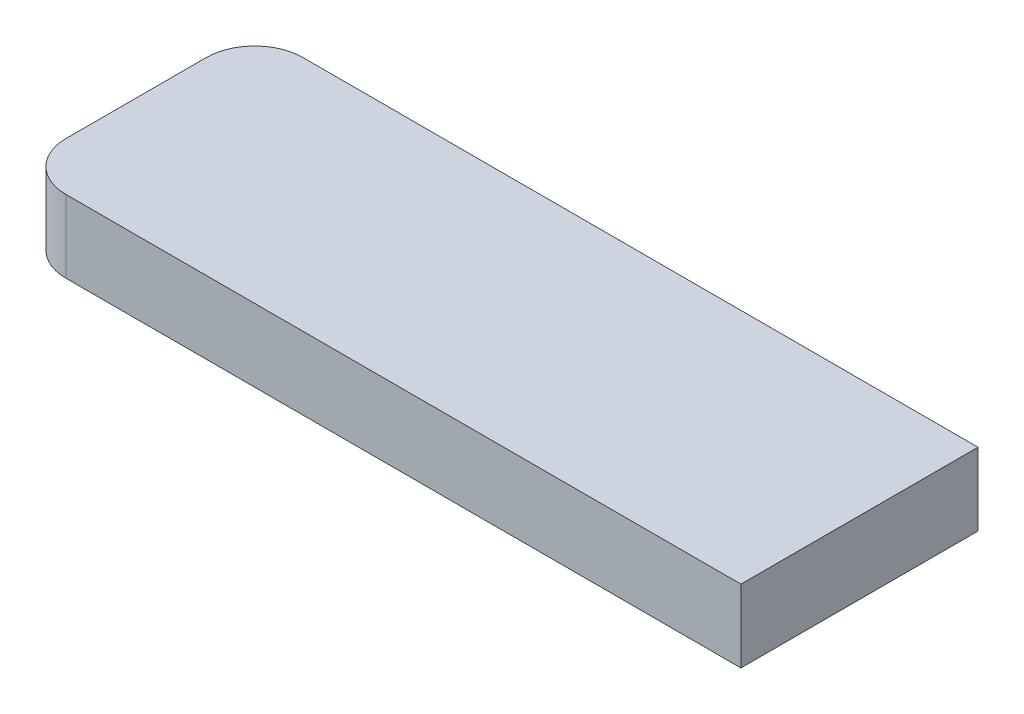
ISO-10303-21;
HEADER;
FILE_DESCRIPTION(('STEP AP214'),'2;1');
FILE_NAME('part.step','',(''),(''),'','','');
FILE_SCHEMA(('AUTOMOTIVE_DESIGN { 1 0 10303 214 1 1 1 1 }'));
ENDSEC;
DATA;
#1=APPLICATION_CONTEXT('core data for automotive mechanical design processes');
#2=APPLICATION_PROTOCOL_DEFINITION('international standard','automotive_design',2000,#1);
#3=PRODUCT_CONTEXT('',#1,'mechanical');
#4=PRODUCT('Part','Part','',(#3));
#5=PRODUCT_RELATED_PRODUCT_CATEGORY('part','',(#4));
#6=PRODUCT_DEFINITION_FORMATION('','',#4);
#7=PRODUCT_DEFINITION_CONTEXT('part definition',#1,'design');
#8=PRODUCT_DEFINITION('design','',#6,#7);
#9=PRODUCT_DEFINITION_SHAPE('','',#8);
#10=(LENGTH_UNIT() NAMED_UNIT(*) SI_UNIT(.MILLI.,.METRE.));
#11=(NAMED_UNIT(*) PLANE_ANGLE_UNIT() SI_UNIT($,.RADIAN.));
#12=(NAMED_UNIT(*) SI_UNIT($,.STERADIAN.) SOLID_ANGLE_UNIT());
#13=UNCERTAINTY_MEASURE_WITH_UNIT(LENGTH_MEASURE(1.E-05),#10,'distance_accuracy_value','');
#14=(GEOMETRIC_REPRESENTATION_CONTEXT(3) GLOBAL_UNCERTAINTY_ASSIGNED_CONTEXT((#13)) GLOBAL_UNIT_ASSIGNED_CONTEXT((#10,
#11,#12)) REPRESENTATION_CONTEXT('',''));
#15=CARTESIAN_POINT('',(0.,0.,0.));
#16=DIRECTION('',(0.,0.,1.));
#17=DIRECTION('',(1.,0.,0.));
#18=AXIS2_PLACEMENT_3D('',#15,#16,#17);
#19=CARTESIAN_POINT('',(300.,1.71683972880179E-13,0.));
#20=DIRECTION('',(-1.,0.,0.));
#21=DIRECTION('',(0.,-1.,0.));
#22=AXIS2_PLACEMENT_3D('',#19,#20,#21);
#23=PLANE('',#22);
#24=DIRECTION('',(0.,1.,0.));
#25=VECTOR('',#24,1.);
#26=CARTESIAN_POINT('',(300.,-120.,13.1));
#27=LINE('',#26,#25);
#28=CARTESIAN_POINT('',(300.,-50.,13.1));
#29=VERTEX_POINT('',#28);
#30=CARTESIAN_POINT('',(300.,-47.,13.1));
#31=VERTEX_POINT('',#30);
#32=EDGE_CURVE('E35',#29,#31,#27,.T.);
#33=ORIENTED_EDGE('',*,*,#32,.T.);
#34=DIRECTION('',(0.,0.,1.));
#35=VECTOR('',#34,1.);
#36=CARTESIAN_POINT('',(300.,-47.,3.));
#37=LINE('',#36,#35);
#38=CARTESIAN_POINT('',(300.,-47.,22.9));
#39=VERTEX_POINT('',#38);
#40=EDGE_CURVE('E90',#31,#39,#37,.T.);
#41=ORIENTED_EDGE('',*,*,#40,.T.);
#42=DIRECTION('',(0.,1.,0.));
#43=VECTOR('',#42,1.);
#44=CARTESIAN_POINT('',(300.,-120.,22.9));
#45=LINE('',#44,#43);
#46=CARTESIAN_POINT('',(300.,-50.,22.9));
#47=VERTEX_POINT('',#46);
#48=EDGE_CURVE('E55',#47,#39,#45,.T.);
#49=ORIENTED_EDGE('',*,*,#48,.F.);
#50=DIRECTION('',(0.,0.,-1.));
#51=VECTOR('',#50,1.);
#52=CARTESIAN_POINT('',(300.,-50.,60.));
#53=LINE('',#52,#51);
#54=EDGE_CURVE('E48',#47,#29,#53,.T.);
#55=ORIENTED_EDGE('',*,*,#54,.T.);
#56=EDGE_LOOP('',(#33,#41,#49,#55));
#57=FACE_BOUND('',#56,.T.);
#58=ADVANCED_FACE('F32',(#57),#23,.F.);
#59=CARTESIAN_POINT('',(270.1,-120.,13.1));
#60=DIRECTION('',(1.,0.,0.));
#61=DIRECTION('',(0.,0.,-1.));
#62=AXIS2_PLACEMENT_3D('',#59,#60,#61);
#63=PLANE('',#62);
#64=DIRECTION('',(0.,0.,-1.));
#65=VECTOR('',#64,1.);
#66=CARTESIAN_POINT('',(270.1,-50.,60.));
#67=LINE('',#66,#65);
#68=CARTESIAN_POINT('',(270.1,-50.,20.9));
#69=VERTEX_POINT('',#68);
#70=CARTESIAN_POINT('',(270.1,-50.,15.1));
#71=VERTEX_POINT('',#70);
#72=EDGE_CURVE('E11',#69,#71,#67,.T.);
#73=ORIENTED_EDGE('',*,*,#72,.F.);
#74=DIRECTION('',(0.,-1.,0.));
#75=VECTOR('',#74,1.);
#76=CARTESIAN_POINT('',(270.1,-120.,20.9));
#77=LINE('',#76,#75);
#78=CARTESIAN_POINT('',(270.1,-47.,20.9));
#79=VERTEX_POINT('',#78);
#80=EDGE_CURVE('E127',#69,#79,#77,.F.);
#81=ORIENTED_EDGE('',*,*,#80,.T.);
#82=DIRECTION('',(0.,0.,1.));
#83=VECTOR('',#82,1.);
#84=CARTESIAN_POINT('',(270.1,-47.,3.));
#85=LINE('',#84,#83);
#86=CARTESIAN_POINT('',(270.1,-47.,15.1));
#87=VERTEX_POINT('',#86);
#88=EDGE_CURVE('E40',#87,#79,#85,.T.);
#89=ORIENTED_EDGE('',*,*,#88,.F.);
#90=DIRECTION('',(0.,1.,0.));
#91=VECTOR('',#90,1.);
#92=CARTESIAN_POINT('',(270.1,-120.,15.1));
#93=LINE('',#92,#91);
#94=EDGE_CURVE('E125',#87,#71,#93,.F.);
#95=ORIENTED_EDGE('',*,*,#94,.T.);
#96=EDGE_LOOP('',(#73,#81,#89,#95));
#97=FACE_BOUND('',#96,.T.);
#98=ADVANCED_FACE('F137',(#97),#63,.F.);
#99=CARTESIAN_POINT('',(272.1,-120.,20.9));
#100=DIRECTION('',(0.,-1.,0.));
#101=DIRECTION('',(0.,0.,-1.));
#102=AXIS2_PLACEMENT_3D('',#99,#100,#101);
#103=CYLINDRICAL_SURFACE('',#102,2.);
#104=CARTESIAN_POINT('',(272.1,-47.,20.9));
#105=DIRECTION('',(0.,-1.,0.));
#106=DIRECTION('',(0.,0.,-1.));
#107=AXIS2_PLACEMENT_3D('',#104,#105,#106);
#108=CIRCLE('',#107,2.);
#109=CARTESIAN_POINT('',(272.1,-47.,22.9));
#110=VERTEX_POINT('',#109);
#111=EDGE_CURVE('E115',#79,#110,#108,.F.);
#112=ORIENTED_EDGE('',*,*,#111,.F.);
#113=ORIENTED_EDGE('',*,*,#80,.F.);
#114=CARTESIAN_POINT('',(272.1,-50.,20.9));
#115=DIRECTION('',(0.,1.,0.));
#116=DIRECTION('',(0.,0.,1.));
#117=AXIS2_PLACEMENT_3D('',#114,#115,#116);
#118=CIRCLE('',#117,2.);
#119=CARTESIAN_POINT('',(272.1,-50.,22.9));
#120=VERTEX_POINT('',#119);
#121=EDGE_CURVE('E123',#120,#69,#118,.F.);
#122=ORIENTED_EDGE('',*,*,#121,.F.);
#123=DIRECTION('',(0.,-1.,0.));
#124=VECTOR('',#123,1.);
#125=CARTESIAN_POINT('',(272.1,-120.,22.9));
#126=LINE('',#125,#124);
#127=EDGE_CURVE('E118',#110,#120,#126,.T.);
#128=ORIENTED_EDGE('',*,*,#127,.F.);
#129=EDGE_LOOP('',(#112,#113,#122,#128));
#130=FACE_BOUND('',#129,.T.);
#131=ADVANCED_FACE('F147',(#130),#103,.T.);
#132=CARTESIAN_POINT('',(-300.,-47.,3.));
#133=DIRECTION('',(0.,-1.,0.));
#134=DIRECTION('',(0.,0.,-1.));
#135=AXIS2_PLACEMENT_3D('',#132,#133,#134);
#136=PLANE('',#135);
#137=ORIENTED_EDGE('',*,*,#88,.T.);
#138=ORIENTED_EDGE('',*,*,#111,.T.);
#139=DIRECTION('',(1.,0.,0.));
#140=VECTOR('',#139,1.);
#141=CARTESIAN_POINT('',(-300.,-47.,22.9000000000001));
#142=LINE('',#141,#140);
#143=EDGE_CURVE('E112',#110,#39,#142,.T.);
#144=ORIENTED_EDGE('',*,*,#143,.T.);
#145=ORIENTED_EDGE('',*,*,#40,.F.);
#146=DIRECTION('',(-1.,0.,0.));
#147=VECTOR('',#146,1.);
#148=CARTESIAN_POINT('',(-300.,-47.,13.1000000000001));
#149=LINE('',#148,#147);
#150=CARTESIAN_POINT('',(272.1,-47.,13.1));
#151=VERTEX_POINT('',#150);
#152=EDGE_CURVE('E99',#31,#151,#149,.T.);
#153=ORIENTED_EDGE('',*,*,#152,.T.);
#154=CARTESIAN_POINT('',(272.1,-47.,15.1));
#155=DIRECTION('',(0.,-1.,0.));
#156=DIRECTION('',(0.,0.,-1.));
#157=AXIS2_PLACEMENT_3D('',#154,#155,#156);
#158=CIRCLE('',#157,2.);
#159=EDGE_CURVE('E129',#151,#87,#158,.F.);
#160=ORIENTED_EDGE('',*,*,#159,.T.);
#161=EDGE_LOOP('',(#137,#138,#144,#145,#153,#160));
#162=FACE_BOUND('',#161,.T.);
#163=ADVANCED_FACE('F113',(#162),#136,.F.);
#164=CARTESIAN_POINT('',(272.1,-120.,15.1));
#165=DIRECTION('',(0.,1.,0.));
#166=DIRECTION('',(0.,0.,1.));
#167=AXIS2_PLACEMENT_3D('',#164,#165,#166);
#168=CYLINDRICAL_SURFACE('',#167,2.);
#169=CARTESIAN_POINT('',(272.1,-50.,15.1));
#170=DIRECTION('',(0.,1.,0.));
#171=DIRECTION('',(0.,0.,1.));
#172=AXIS2_PLACEMENT_3D('',#169,#170,#171);
#173=CIRCLE('',#172,2.);
#174=CARTESIAN_POINT('',(272.1,-50.,13.1));
#175=VERTEX_POINT('',#174);
#176=EDGE_CURVE('E102',#71,#175,#173,.F.);
#177=ORIENTED_EDGE('',*,*,#176,.F.);
#178=ORIENTED_EDGE('',*,*,#94,.F.);
#179=ORIENTED_EDGE('',*,*,#159,.F.);
#180=DIRECTION('',(0.,1.,0.));
#181=VECTOR('',#180,1.);
#182=CARTESIAN_POINT('',(272.1,-120.,13.1));
#183=LINE('',#182,#181);
#184=EDGE_CURVE('E89',#175,#151,#183,.T.);
#185=ORIENTED_EDGE('',*,*,#184,.F.);
#186=EDGE_LOOP('',(#177,#178,#179,#185));
#187=FACE_BOUND('',#186,.T.);
#188=ADVANCED_FACE('F139',(#187),#168,.T.);
#189=CARTESIAN_POINT('',(-300.,-50.,60.));
#190=DIRECTION('',(0.,1.,0.));
#191=DIRECTION('',(0.,0.,1.));
#192=AXIS2_PLACEMENT_3D('',#189,#190,#191);
#193=PLANE('',#192);
#194=DIRECTION('',(-1.,0.,0.));
#195=VECTOR('',#194,1.);
#196=CARTESIAN_POINT('',(-300.,-50.,22.9000000000001));
#197=LINE('',#196,#195);
#198=EDGE_CURVE('E109',#47,#120,#197,.T.);
#199=ORIENTED_EDGE('',*,*,#198,.T.);
#200=ORIENTED_EDGE('',*,*,#121,.T.);
#201=ORIENTED_EDGE('',*,*,#72,.T.);
#202=ORIENTED_EDGE('',*,*,#176,.T.);
#203=DIRECTION('',(1.,0.,0.));
#204=VECTOR('',#203,1.);
#205=CARTESIAN_POINT('',(-300.,-50.,13.1000000000001));
#206=LINE('',#205,#204);
#207=EDGE_CURVE('E96',#175,#29,#206,.T.);
#208=ORIENTED_EDGE('',*,*,#207,.T.);
#209=ORIENTED_EDGE('',*,*,#54,.F.);
#210=EDGE_LOOP('',(#199,#200,#201,#202,#208,#209));
#211=FACE_BOUND('',#210,.T.);
#212=ADVANCED_FACE('F100',(#211),#193,.F.);
#213=CARTESIAN_POINT('',(300.,-120.,13.1));
#214=DIRECTION('',(0.,0.,1.));
#215=DIRECTION('',(1.,0.,0.));
#216=AXIS2_PLACEMENT_3D('',#213,#214,#215);
#217=PLANE('',#216);
#218=ORIENTED_EDGE('',*,*,#207,.F.);
#219=ORIENTED_EDGE('',*,*,#184,.T.);
#220=ORIENTED_EDGE('',*,*,#152,.F.);
#221=ORIENTED_EDGE('',*,*,#32,.F.);
#222=EDGE_LOOP('',(#218,#219,#220,#221));
#223=FACE_BOUND('',#222,.T.);
#224=ADVANCED_FACE('F94',(#223),#217,.F.);
#225=CARTESIAN_POINT('',(300.,-120.,22.9));
#226=DIRECTION('',(0.,0.,-1.));
#227=DIRECTION('',(-1.,0.,0.));
#228=AXIS2_PLACEMENT_3D('',#225,#226,#227);
#229=PLANE('',#228);
#230=ORIENTED_EDGE('',*,*,#143,.F.);
#231=ORIENTED_EDGE('',*,*,#127,.T.);
#232=ORIENTED_EDGE('',*,*,#198,.F.);
#233=ORIENTED_EDGE('',*,*,#48,.T.);
#234=EDGE_LOOP('',(#230,#231,#232,#233));
#235=FACE_BOUND('',#234,.T.);
#236=ADVANCED_FACE('F151',(#235),#229,.F.);
#237=CLOSED_SHELL('',(#58,#98,#131,#163,#188,#212,#224,#236));
#238=MANIFOLD_SOLID_BREP('B2',#237);
#239=ADVANCED_BREP_SHAPE_REPRESENTATION('',(#18,#238),#14);
#240=SHAPE_DEFINITION_REPRESENTATION(#9,#239);
ENDSEC;
END-ISO-10303-21;
